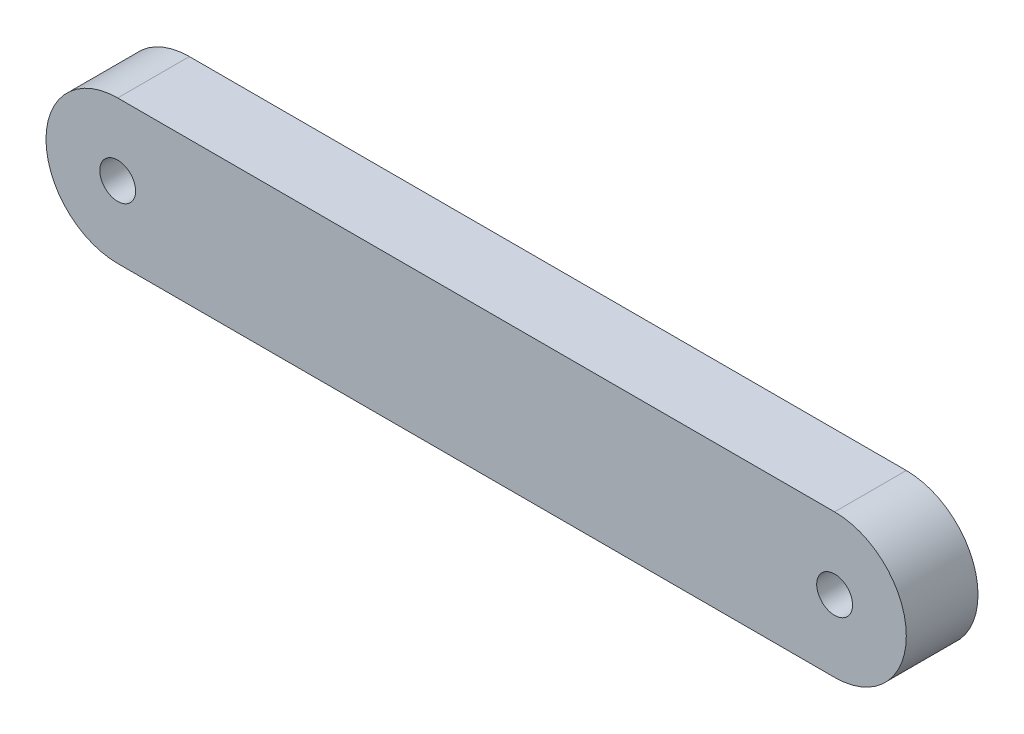
ISO-10303-21;
HEADER;
FILE_DESCRIPTION(('STEP AP214'),'2;1');
FILE_NAME('part.step','',(''),(''),'','','');
FILE_SCHEMA(('AUTOMOTIVE_DESIGN { 1 0 10303 214 1 1 1 1 }'));
ENDSEC;
DATA;
#1=APPLICATION_CONTEXT('core data for automotive mechanical design processes');
#2=APPLICATION_PROTOCOL_DEFINITION('international standard','automotive_design',2000,#1);
#3=PRODUCT_CONTEXT('',#1,'mechanical');
#4=PRODUCT('Part','Part','',(#3));
#5=PRODUCT_RELATED_PRODUCT_CATEGORY('part','',(#4));
#6=PRODUCT_DEFINITION_FORMATION('','',#4);
#7=PRODUCT_DEFINITION_CONTEXT('part definition',#1,'design');
#8=PRODUCT_DEFINITION('design','',#6,#7);
#9=PRODUCT_DEFINITION_SHAPE('','',#8);
#10=(LENGTH_UNIT() NAMED_UNIT(*) SI_UNIT(.MILLI.,.METRE.));
#11=(NAMED_UNIT(*) PLANE_ANGLE_UNIT() SI_UNIT($,.RADIAN.));
#12=(NAMED_UNIT(*) SI_UNIT($,.STERADIAN.) SOLID_ANGLE_UNIT());
#13=UNCERTAINTY_MEASURE_WITH_UNIT(LENGTH_MEASURE(1.E-05),#10,'distance_accuracy_value','');
#14=(GEOMETRIC_REPRESENTATION_CONTEXT(3) GLOBAL_UNCERTAINTY_ASSIGNED_CONTEXT((#13)) GLOBAL_UNIT_ASSIGNED_CONTEXT((#10,
#11,#12)) REPRESENTATION_CONTEXT('',''));
#15=CARTESIAN_POINT('',(0.,0.,0.));
#16=DIRECTION('',(0.,0.,1.));
#17=DIRECTION('',(1.,0.,0.));
#18=AXIS2_PLACEMENT_3D('',#15,#16,#17);
#19=CARTESIAN_POINT('',(0.,0.,2.54));
#20=DIRECTION('',(0.,0.,-1.));
#21=DIRECTION('',(-1.,0.,0.));
#22=AXIS2_PLACEMENT_3D('',#19,#20,#21);
#23=CYLINDRICAL_SURFACE('',#22,2.54);
#24=CARTESIAN_POINT('',(0.,0.,0.));
#25=DIRECTION('',(0.,0.,1.));
#26=DIRECTION('',(1.,0.,0.));
#27=AXIS2_PLACEMENT_3D('',#24,#25,#26);
#28=CIRCLE('',#27,2.54);
#29=CARTESIAN_POINT('',(0.,2.54,0.));
#30=VERTEX_POINT('',#29);
#31=CARTESIAN_POINT('',(0.,-2.54,0.));
#32=VERTEX_POINT('',#31);
#33=EDGE_CURVE('E96',#30,#32,#28,.T.);
#34=ORIENTED_EDGE('',*,*,#33,.T.);
#35=DIRECTION('',(0.,0.,-1.));
#36=VECTOR('',#35,1.);
#37=CARTESIAN_POINT('',(0.,-2.54,2.54));
#38=LINE('',#37,#36);
#39=CARTESIAN_POINT('',(0.,-2.54,2.54));
#40=VERTEX_POINT('',#39);
#41=EDGE_CURVE('E11',#40,#32,#38,.T.);
#42=ORIENTED_EDGE('',*,*,#41,.F.);
#43=CARTESIAN_POINT('',(0.,0.,2.54));
#44=DIRECTION('',(0.,0.,1.));
#45=DIRECTION('',(1.,0.,0.));
#46=AXIS2_PLACEMENT_3D('',#43,#44,#45);
#47=CIRCLE('',#46,2.54);
#48=CARTESIAN_POINT('',(0.,2.54,2.54));
#49=VERTEX_POINT('',#48);
#50=EDGE_CURVE('E84',#49,#40,#47,.T.);
#51=ORIENTED_EDGE('',*,*,#50,.F.);
#52=DIRECTION('',(0.,0.,-1.));
#53=VECTOR('',#52,1.);
#54=CARTESIAN_POINT('',(0.,2.54,2.54));
#55=LINE('',#54,#53);
#56=EDGE_CURVE('E92',#49,#30,#55,.T.);
#57=ORIENTED_EDGE('',*,*,#56,.T.);
#58=EDGE_LOOP('',(#34,#42,#51,#57));
#59=FACE_BOUND('',#58,.T.);
#60=ADVANCED_FACE('F33',(#59),#23,.T.);
#61=CARTESIAN_POINT('',(0.,-2.54,2.54));
#62=DIRECTION('',(0.,1.,0.));
#63=DIRECTION('',(0.,0.,1.));
#64=AXIS2_PLACEMENT_3D('',#61,#62,#63);
#65=PLANE('',#64);
#66=DIRECTION('',(1.,0.,0.));
#67=VECTOR('',#66,1.);
#68=CARTESIAN_POINT('',(0.,-2.54,0.));
#69=LINE('',#68,#67);
#70=CARTESIAN_POINT('',(25.4,-2.54,0.));
#71=VERTEX_POINT('',#70);
#72=EDGE_CURVE('E88',#32,#71,#69,.T.);
#73=ORIENTED_EDGE('',*,*,#72,.T.);
#74=DIRECTION('',(0.,0.,-1.));
#75=VECTOR('',#74,1.);
#76=CARTESIAN_POINT('',(25.4,-2.54,2.54));
#77=LINE('',#76,#75);
#78=CARTESIAN_POINT('',(25.4,-2.54,2.54));
#79=VERTEX_POINT('',#78);
#80=EDGE_CURVE('E41',#79,#71,#77,.T.);
#81=ORIENTED_EDGE('',*,*,#80,.F.);
#82=DIRECTION('',(1.,0.,0.));
#83=VECTOR('',#82,1.);
#84=CARTESIAN_POINT('',(0.,-2.54,2.54));
#85=LINE('',#84,#83);
#86=EDGE_CURVE('E79',#40,#79,#85,.T.);
#87=ORIENTED_EDGE('',*,*,#86,.F.);
#88=ORIENTED_EDGE('',*,*,#41,.T.);
#89=EDGE_LOOP('',(#73,#81,#87,#88));
#90=FACE_BOUND('',#89,.T.);
#91=ADVANCED_FACE('F87',(#90),#65,.F.);
#92=CARTESIAN_POINT('',(25.4,0.,2.54));
#93=DIRECTION('',(0.,0.,-1.));
#94=DIRECTION('',(-1.,0.,0.));
#95=AXIS2_PLACEMENT_3D('',#92,#93,#94);
#96=CYLINDRICAL_SURFACE('',#95,2.54);
#97=CARTESIAN_POINT('',(25.4,0.,0.));
#98=DIRECTION('',(0.,0.,1.));
#99=DIRECTION('',(1.,0.,0.));
#100=AXIS2_PLACEMENT_3D('',#97,#98,#99);
#101=CIRCLE('',#100,2.54);
#102=CARTESIAN_POINT('',(25.4,2.54,0.));
#103=VERTEX_POINT('',#102);
#104=EDGE_CURVE('E66',#71,#103,#101,.T.);
#105=ORIENTED_EDGE('',*,*,#104,.T.);
#106=DIRECTION('',(0.,0.,-1.));
#107=VECTOR('',#106,1.);
#108=CARTESIAN_POINT('',(25.4,2.54,2.54));
#109=LINE('',#108,#107);
#110=CARTESIAN_POINT('',(25.4,2.54,2.54));
#111=VERTEX_POINT('',#110);
#112=EDGE_CURVE('E89',#111,#103,#109,.T.);
#113=ORIENTED_EDGE('',*,*,#112,.F.);
#114=CARTESIAN_POINT('',(25.4,0.,2.54));
#115=DIRECTION('',(0.,0.,1.));
#116=DIRECTION('',(1.,0.,0.));
#117=AXIS2_PLACEMENT_3D('',#114,#115,#116);
#118=CIRCLE('',#117,2.54);
#119=EDGE_CURVE('E82',#79,#111,#118,.T.);
#120=ORIENTED_EDGE('',*,*,#119,.F.);
#121=ORIENTED_EDGE('',*,*,#80,.T.);
#122=EDGE_LOOP('',(#105,#113,#120,#121));
#123=FACE_BOUND('',#122,.T.);
#124=ADVANCED_FACE('F90',(#123),#96,.T.);
#125=CARTESIAN_POINT('',(0.,2.54,2.54));
#126=DIRECTION('',(0.,-1.,0.));
#127=DIRECTION('',(0.,0.,-1.));
#128=AXIS2_PLACEMENT_3D('',#125,#126,#127);
#129=PLANE('',#128);
#130=DIRECTION('',(-1.,0.,0.));
#131=VECTOR('',#130,1.);
#132=CARTESIAN_POINT('',(0.,2.54,0.));
#133=LINE('',#132,#131);
#134=EDGE_CURVE('E72',#103,#30,#133,.T.);
#135=ORIENTED_EDGE('',*,*,#134,.T.);
#136=ORIENTED_EDGE('',*,*,#56,.F.);
#137=DIRECTION('',(-1.,0.,0.));
#138=VECTOR('',#137,1.);
#139=CARTESIAN_POINT('',(0.,2.54,2.54));
#140=LINE('',#139,#138);
#141=EDGE_CURVE('E49',#111,#49,#140,.T.);
#142=ORIENTED_EDGE('',*,*,#141,.F.);
#143=ORIENTED_EDGE('',*,*,#112,.T.);
#144=EDGE_LOOP('',(#135,#136,#142,#143));
#145=FACE_BOUND('',#144,.T.);
#146=ADVANCED_FACE('F104',(#145),#129,.F.);
#147=CARTESIAN_POINT('',(0.,0.,2.54));
#148=DIRECTION('',(0.,0.,1.));
#149=DIRECTION('',(1.,0.,0.));
#150=AXIS2_PLACEMENT_3D('',#147,#148,#149);
#151=PLANE('',#150);
#152=CARTESIAN_POINT('',(25.4,0.,2.54));
#153=DIRECTION('',(0.,0.,1.));
#154=DIRECTION('',(1.,0.,0.));
#155=AXIS2_PLACEMENT_3D('',#152,#153,#154);
#156=CIRCLE('',#155,0.635);
#157=CARTESIAN_POINT('',(26.035,0.,2.54));
#158=VERTEX_POINT('',#157);
#159=EDGE_CURVE('E115',#158,#158,#156,.F.);
#160=ORIENTED_EDGE('',*,*,#159,.T.);
#161=EDGE_LOOP('',(#160));
#162=FACE_BOUND('',#161,.T.);
#163=CARTESIAN_POINT('',(0.,0.,2.54));
#164=DIRECTION('',(0.,0.,1.));
#165=DIRECTION('',(1.,0.,0.));
#166=AXIS2_PLACEMENT_3D('',#163,#164,#165);
#167=CIRCLE('',#166,0.635);
#168=CARTESIAN_POINT('',(0.635,0.,2.54));
#169=VERTEX_POINT('',#168);
#170=EDGE_CURVE('E99',#169,#169,#167,.T.);
#171=ORIENTED_EDGE('',*,*,#170,.F.);
#172=EDGE_LOOP('',(#171));
#173=FACE_BOUND('',#172,.T.);
#174=ORIENTED_EDGE('',*,*,#50,.T.);
#175=ORIENTED_EDGE('',*,*,#86,.T.);
#176=ORIENTED_EDGE('',*,*,#119,.T.);
#177=ORIENTED_EDGE('',*,*,#141,.T.);
#178=EDGE_LOOP('',(#174,#175,#176,#177));
#179=FACE_BOUND('',#178,.T.);
#180=ADVANCED_FACE('F80',(#162,#173,#179),#151,.T.);
#181=CARTESIAN_POINT('',(0.,0.,0.));
#182=DIRECTION('',(0.,0.,1.));
#183=DIRECTION('',(1.,0.,0.));
#184=AXIS2_PLACEMENT_3D('',#181,#182,#183);
#185=PLANE('',#184);
#186=CARTESIAN_POINT('',(25.4,0.,0.));
#187=DIRECTION('',(0.,0.,-1.));
#188=DIRECTION('',(-1.,0.,0.));
#189=AXIS2_PLACEMENT_3D('',#186,#187,#188);
#190=CIRCLE('',#189,0.635);
#191=CARTESIAN_POINT('',(24.765,0.,0.));
#192=VERTEX_POINT('',#191);
#193=EDGE_CURVE('E118',#192,#192,#190,.T.);
#194=ORIENTED_EDGE('',*,*,#193,.F.);
#195=EDGE_LOOP('',(#194));
#196=FACE_BOUND('',#195,.T.);
#197=CARTESIAN_POINT('',(0.,0.,0.));
#198=DIRECTION('',(0.,0.,1.));
#199=DIRECTION('',(1.,0.,0.));
#200=AXIS2_PLACEMENT_3D('',#197,#198,#199);
#201=CIRCLE('',#200,0.635);
#202=CARTESIAN_POINT('',(0.635,0.,0.));
#203=VERTEX_POINT('',#202);
#204=EDGE_CURVE('E112',#203,#203,#201,.T.);
#205=ORIENTED_EDGE('',*,*,#204,.T.);
#206=EDGE_LOOP('',(#205));
#207=FACE_BOUND('',#206,.T.);
#208=ORIENTED_EDGE('',*,*,#33,.F.);
#209=ORIENTED_EDGE('',*,*,#134,.F.);
#210=ORIENTED_EDGE('',*,*,#104,.F.);
#211=ORIENTED_EDGE('',*,*,#72,.F.);
#212=EDGE_LOOP('',(#208,#209,#210,#211));
#213=FACE_BOUND('',#212,.T.);
#214=ADVANCED_FACE('F107',(#196,#207,#213),#185,.F.);
#215=CARTESIAN_POINT('',(0.,0.,0.));
#216=DIRECTION('',(0.,0.,1.));
#217=DIRECTION('',(1.,0.,0.));
#218=AXIS2_PLACEMENT_3D('',#215,#216,#217);
#219=CYLINDRICAL_SURFACE('',#218,0.635);
#220=ORIENTED_EDGE('',*,*,#170,.T.);
#221=EDGE_LOOP('',(#220));
#222=FACE_BOUND('',#221,.T.);
#223=ORIENTED_EDGE('',*,*,#204,.F.);
#224=EDGE_LOOP('',(#223));
#225=FACE_BOUND('',#224,.T.);
#226=ADVANCED_FACE('F126',(#222,#225),#219,.F.);
#227=CARTESIAN_POINT('',(25.4,0.,0.));
#228=DIRECTION('',(0.,0.,1.));
#229=DIRECTION('',(1.,0.,0.));
#230=AXIS2_PLACEMENT_3D('',#227,#228,#229);
#231=CYLINDRICAL_SURFACE('',#230,0.635);
#232=ORIENTED_EDGE('',*,*,#159,.F.);
#233=EDGE_LOOP('',(#232));
#234=FACE_BOUND('',#233,.T.);
#235=ORIENTED_EDGE('',*,*,#193,.T.);
#236=EDGE_LOOP('',(#235));
#237=FACE_BOUND('',#236,.T.);
#238=ADVANCED_FACE('F122',(#234,#237),#231,.F.);
#239=CLOSED_SHELL('',(#60,#91,#124,#146,#180,#214,#226,#238));
#240=MANIFOLD_SOLID_BREP('B2',#239);
#241=ADVANCED_BREP_SHAPE_REPRESENTATION('',(#18,#240),#14);
#242=SHAPE_DEFINITION_REPRESENTATION(#9,#241);
ENDSEC;
END-ISO-10303-21;
